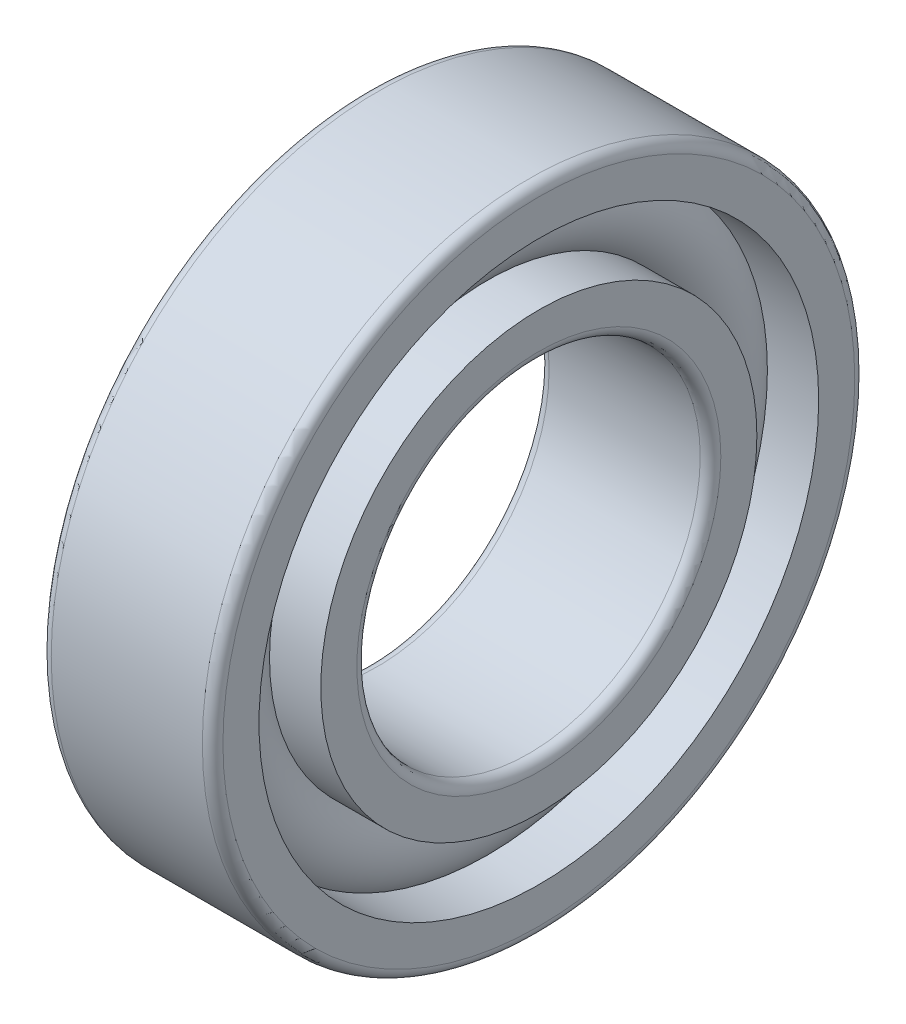
ISO-10303-21;
HEADER;
FILE_DESCRIPTION(('STEP AP214'),'2;1');
FILE_NAME('part.step','',(''),(''),'','','');
FILE_SCHEMA(('AUTOMOTIVE_DESIGN { 1 0 10303 214 1 1 1 1 }'));
ENDSEC;
DATA;
#1=APPLICATION_CONTEXT('core data for automotive mechanical design processes');
#2=APPLICATION_PROTOCOL_DEFINITION('international standard','automotive_design',2000,#1);
#3=PRODUCT_CONTEXT('',#1,'mechanical');
#4=PRODUCT('Part','Part','',(#3));
#5=PRODUCT_RELATED_PRODUCT_CATEGORY('part','',(#4));
#6=PRODUCT_DEFINITION_FORMATION('','',#4);
#7=PRODUCT_DEFINITION_CONTEXT('part definition',#1,'design');
#8=PRODUCT_DEFINITION('design','',#6,#7);
#9=PRODUCT_DEFINITION_SHAPE('','',#8);
#10=(LENGTH_UNIT() NAMED_UNIT(*) SI_UNIT(.MILLI.,.METRE.));
#11=(NAMED_UNIT(*) PLANE_ANGLE_UNIT() SI_UNIT($,.RADIAN.));
#12=(NAMED_UNIT(*) SI_UNIT($,.STERADIAN.) SOLID_ANGLE_UNIT());
#13=UNCERTAINTY_MEASURE_WITH_UNIT(LENGTH_MEASURE(1.E-05),#10,'distance_accuracy_value','');
#14=(GEOMETRIC_REPRESENTATION_CONTEXT(3) GLOBAL_UNCERTAINTY_ASSIGNED_CONTEXT((#13)) GLOBAL_UNIT_ASSIGNED_CONTEXT((#10,
#11,#12)) REPRESENTATION_CONTEXT('',''));
#15=CARTESIAN_POINT('',(0.,0.,0.));
#16=DIRECTION('',(0.,0.,1.));
#17=DIRECTION('',(1.,0.,0.));
#18=AXIS2_PLACEMENT_3D('',#15,#16,#17);
#19=CARTESIAN_POINT('',(0.,0.,0.));
#20=DIRECTION('',(-1.,0.,0.));
#21=DIRECTION('',(0.,0.,1.));
#22=AXIS2_PLACEMENT_3D('',#19,#20,#21);
#23=TOROIDAL_SURFACE('',#22,7.25,1.35);
#24=CARTESIAN_POINT('',(1.0062305898749,0.,0.));
#25=DIRECTION('',(-1.,0.,0.));
#26=DIRECTION('',(0.,0.,1.));
#27=AXIS2_PLACEMENT_3D('',#24,#25,#26);
#28=CIRCLE('',#27,8.15000000000001);
#29=CARTESIAN_POINT('',(1.0062305898749,0.,8.15000000000001));
#30=VERTEX_POINT('',#29);
#31=EDGE_CURVE('E35',#30,#30,#28,.F.);
#32=ORIENTED_EDGE('',*,*,#31,.T.);
#33=EDGE_LOOP('',(#32));
#34=FACE_BOUND('',#33,.T.);
#35=CARTESIAN_POINT('',(1.00623058987491,0.,0.));
#36=DIRECTION('',(-1.,0.,0.));
#37=DIRECTION('',(0.,0.,1.));
#38=AXIS2_PLACEMENT_3D('',#35,#36,#37);
#39=CIRCLE('',#38,6.35);
#40=CARTESIAN_POINT('',(1.00623058987491,0.,6.35));
#41=VERTEX_POINT('',#40);
#42=EDGE_CURVE('E10',#41,#41,#39,.T.);
#43=ORIENTED_EDGE('',*,*,#42,.T.);
#44=EDGE_LOOP('',(#43));
#45=FACE_BOUND('',#44,.T.);
#46=ADVANCED_FACE('F31',(#34,#45),#23,.T.);
#47=CARTESIAN_POINT('',(-20.6375,0.,0.));
#48=DIRECTION('',(1.,0.,0.));
#49=DIRECTION('',(0.,0.,-1.));
#50=AXIS2_PLACEMENT_3D('',#47,#48,#49);
#51=CYLINDRICAL_SURFACE('',#50,6.35);
#52=CARTESIAN_POINT('',(2.5,0.,0.));
#53=DIRECTION('',(1.,0.,0.));
#54=DIRECTION('',(0.,0.,-1.));
#55=AXIS2_PLACEMENT_3D('',#52,#53,#54);
#56=CIRCLE('',#55,6.35);
#57=CARTESIAN_POINT('',(2.5,0.,-6.35));
#58=VERTEX_POINT('',#57);
#59=EDGE_CURVE('E44',#58,#58,#56,.T.);
#60=ORIENTED_EDGE('',*,*,#59,.F.);
#61=EDGE_LOOP('',(#60));
#62=FACE_BOUND('',#61,.T.);
#63=ORIENTED_EDGE('',*,*,#42,.F.);
#64=EDGE_LOOP('',(#63));
#65=FACE_BOUND('',#64,.T.);
#66=ADVANCED_FACE('F83',(#62,#65),#51,.T.);
#67=CARTESIAN_POINT('',(-20.6375,0.,0.));
#68=DIRECTION('',(1.,0.,0.));
#69=DIRECTION('',(0.,0.,-1.));
#70=AXIS2_PLACEMENT_3D('',#67,#68,#69);
#71=CYLINDRICAL_SURFACE('',#70,6.35);
#72=CARTESIAN_POINT('',(-2.5,0.,0.));
#73=DIRECTION('',(1.,0.,0.));
#74=DIRECTION('',(0.,0.,-1.));
#75=AXIS2_PLACEMENT_3D('',#72,#73,#74);
#76=CIRCLE('',#75,6.35);
#77=CARTESIAN_POINT('',(-2.5,0.,-6.35));
#78=VERTEX_POINT('',#77);
#79=EDGE_CURVE('E53',#78,#78,#76,.T.);
#80=ORIENTED_EDGE('',*,*,#79,.T.);
#81=EDGE_LOOP('',(#80));
#82=FACE_BOUND('',#81,.T.);
#83=CARTESIAN_POINT('',(-1.00623058987491,0.,0.));
#84=DIRECTION('',(1.,0.,0.));
#85=DIRECTION('',(0.,0.,-1.));
#86=AXIS2_PLACEMENT_3D('',#83,#84,#85);
#87=CIRCLE('',#86,6.35);
#88=CARTESIAN_POINT('',(-1.00623058987491,0.,-6.35));
#89=VERTEX_POINT('',#88);
#90=EDGE_CURVE('E39',#89,#89,#87,.T.);
#91=ORIENTED_EDGE('',*,*,#90,.F.);
#92=EDGE_LOOP('',(#91));
#93=FACE_BOUND('',#92,.T.);
#94=ADVANCED_FACE('F86',(#82,#93),#71,.T.);
#95=CARTESIAN_POINT('',(2.5,5.3,0.));
#96=DIRECTION('',(1.,0.,0.));
#97=DIRECTION('',(0.,0.,-1.));
#98=AXIS2_PLACEMENT_3D('',#95,#96,#97);
#99=PLANE('',#98);
#100=ORIENTED_EDGE('',*,*,#59,.T.);
#101=EDGE_LOOP('',(#100));
#102=FACE_BOUND('',#101,.T.);
#103=CARTESIAN_POINT('',(2.5,0.,0.));
#104=DIRECTION('',(1.,0.,0.));
#105=DIRECTION('',(0.,0.,-1.));
#106=AXIS2_PLACEMENT_3D('',#103,#104,#105);
#107=CIRCLE('',#106,5.3);
#108=CARTESIAN_POINT('',(2.5,0.,-5.3));
#109=VERTEX_POINT('',#108);
#110=EDGE_CURVE('E75',#109,#109,#107,.T.);
#111=ORIENTED_EDGE('',*,*,#110,.F.);
#112=EDGE_LOOP('',(#111));
#113=FACE_BOUND('',#112,.T.);
#114=ADVANCED_FACE('F80',(#102,#113),#99,.T.);
#115=CARTESIAN_POINT('',(2.2,0.,0.));
#116=DIRECTION('',(1.,0.,0.));
#117=DIRECTION('',(0.,0.,-1.));
#118=AXIS2_PLACEMENT_3D('',#115,#116,#117);
#119=TOROIDAL_SURFACE('',#118,5.3,0.3);
#120=ORIENTED_EDGE('',*,*,#110,.T.);
#121=EDGE_LOOP('',(#120));
#122=FACE_BOUND('',#121,.T.);
#123=CARTESIAN_POINT('',(2.2,0.,0.));
#124=DIRECTION('',(1.,0.,0.));
#125=DIRECTION('',(0.,0.,-1.));
#126=AXIS2_PLACEMENT_3D('',#123,#124,#125);
#127=CIRCLE('',#126,5.);
#128=CARTESIAN_POINT('',(2.2,0.,-5.));
#129=VERTEX_POINT('',#128);
#130=EDGE_CURVE('E72',#129,#129,#127,.T.);
#131=ORIENTED_EDGE('',*,*,#130,.F.);
#132=EDGE_LOOP('',(#131));
#133=FACE_BOUND('',#132,.T.);
#134=ADVANCED_FACE('F97',(#122,#133),#119,.T.);
#135=CARTESIAN_POINT('',(-20.6375,0.,0.));
#136=DIRECTION('',(1.,0.,0.));
#137=DIRECTION('',(0.,0.,-1.));
#138=AXIS2_PLACEMENT_3D('',#135,#136,#137);
#139=CYLINDRICAL_SURFACE('',#138,5.);
#140=ORIENTED_EDGE('',*,*,#130,.T.);
#141=EDGE_LOOP('',(#140));
#142=FACE_BOUND('',#141,.T.);
#143=CARTESIAN_POINT('',(-2.2,0.,0.));
#144=DIRECTION('',(1.,0.,0.));
#145=DIRECTION('',(0.,0.,-1.));
#146=AXIS2_PLACEMENT_3D('',#143,#144,#145);
#147=CIRCLE('',#146,5.);
#148=CARTESIAN_POINT('',(-2.2,0.,-5.));
#149=VERTEX_POINT('',#148);
#150=EDGE_CURVE('E69',#149,#149,#147,.T.);
#151=ORIENTED_EDGE('',*,*,#150,.F.);
#152=EDGE_LOOP('',(#151));
#153=FACE_BOUND('',#152,.T.);
#154=ADVANCED_FACE('F100',(#142,#153),#139,.F.);
#155=CARTESIAN_POINT('',(-2.2,0.,0.));
#156=DIRECTION('',(1.,0.,0.));
#157=DIRECTION('',(0.,0.,-1.));
#158=AXIS2_PLACEMENT_3D('',#155,#156,#157);
#159=TOROIDAL_SURFACE('',#158,5.3,0.3);
#160=ORIENTED_EDGE('',*,*,#150,.T.);
#161=EDGE_LOOP('',(#160));
#162=FACE_BOUND('',#161,.T.);
#163=CARTESIAN_POINT('',(-2.5,0.,0.));
#164=DIRECTION('',(1.,0.,0.));
#165=DIRECTION('',(0.,0.,-1.));
#166=AXIS2_PLACEMENT_3D('',#163,#164,#165);
#167=CIRCLE('',#166,5.3);
#168=CARTESIAN_POINT('',(-2.5,0.,-5.3));
#169=VERTEX_POINT('',#168);
#170=EDGE_CURVE('E66',#169,#169,#167,.T.);
#171=ORIENTED_EDGE('',*,*,#170,.F.);
#172=EDGE_LOOP('',(#171));
#173=FACE_BOUND('',#172,.T.);
#174=ADVANCED_FACE('F104',(#162,#173),#159,.T.);
#175=CARTESIAN_POINT('',(-2.5,6.35,0.));
#176=DIRECTION('',(-1.,0.,0.));
#177=DIRECTION('',(0.,0.,1.));
#178=AXIS2_PLACEMENT_3D('',#175,#176,#177);
#179=PLANE('',#178);
#180=ORIENTED_EDGE('',*,*,#170,.T.);
#181=EDGE_LOOP('',(#180));
#182=FACE_BOUND('',#181,.T.);
#183=ORIENTED_EDGE('',*,*,#79,.F.);
#184=EDGE_LOOP('',(#183));
#185=FACE_BOUND('',#184,.T.);
#186=ADVANCED_FACE('F108',(#182,#185),#179,.T.);
#187=CARTESIAN_POINT('',(-1.0062305898749,0.,0.));
#188=DIRECTION('',(1.,0.,0.));
#189=DIRECTION('',(0.,0.,-1.));
#190=AXIS2_PLACEMENT_3D('',#187,#188,#189);
#191=CIRCLE('',#190,8.15000000000001);
#192=CARTESIAN_POINT('',(-1.0062305898749,0.,-8.15000000000001));
#193=VERTEX_POINT('',#192);
#194=EDGE_CURVE('E47',#193,#193,#191,.F.);
#195=ORIENTED_EDGE('',*,*,#194,.T.);
#196=EDGE_LOOP('',(#195));
#197=FACE_BOUND('',#196,.T.);
#198=ORIENTED_EDGE('',*,*,#90,.T.);
#199=EDGE_LOOP('',(#198));
#200=FACE_BOUND('',#199,.T.);
#201=ADVANCED_FACE('F33',(#197,#200),#23,.T.);
#202=CARTESIAN_POINT('',(-20.6375,0.,0.));
#203=DIRECTION('',(1.,0.,0.));
#204=DIRECTION('',(0.,0.,-1.));
#205=AXIS2_PLACEMENT_3D('',#202,#203,#204);
#206=CYLINDRICAL_SURFACE('',#205,8.15000000000001);
#207=CARTESIAN_POINT('',(2.5,0.,0.));
#208=DIRECTION('',(1.,0.,0.));
#209=DIRECTION('',(0.,0.,-1.));
#210=AXIS2_PLACEMENT_3D('',#207,#208,#209);
#211=CIRCLE('',#210,8.15000000000001);
#212=CARTESIAN_POINT('',(2.5,0.,-8.15000000000001));
#213=VERTEX_POINT('',#212);
#214=EDGE_CURVE('E49',#213,#213,#211,.T.);
#215=ORIENTED_EDGE('',*,*,#214,.T.);
#216=EDGE_LOOP('',(#215));
#217=FACE_BOUND('',#216,.T.);
#218=ORIENTED_EDGE('',*,*,#31,.F.);
#219=EDGE_LOOP('',(#218));
#220=FACE_BOUND('',#219,.T.);
#221=ADVANCED_FACE('F113',(#217,#220),#206,.F.);
#222=CARTESIAN_POINT('',(-20.6375,0.,0.));
#223=DIRECTION('',(1.,0.,0.));
#224=DIRECTION('',(0.,0.,-1.));
#225=AXIS2_PLACEMENT_3D('',#222,#223,#224);
#226=CYLINDRICAL_SURFACE('',#225,8.15000000000001);
#227=CARTESIAN_POINT('',(-2.5,0.,0.));
#228=DIRECTION('',(1.,0.,0.));
#229=DIRECTION('',(0.,0.,-1.));
#230=AXIS2_PLACEMENT_3D('',#227,#228,#229);
#231=CIRCLE('',#230,8.15000000000001);
#232=CARTESIAN_POINT('',(-2.5,0.,-8.15000000000001));
#233=VERTEX_POINT('',#232);
#234=EDGE_CURVE('E144',#233,#233,#231,.T.);
#235=ORIENTED_EDGE('',*,*,#234,.F.);
#236=EDGE_LOOP('',(#235));
#237=FACE_BOUND('',#236,.T.);
#238=ORIENTED_EDGE('',*,*,#194,.F.);
#239=EDGE_LOOP('',(#238));
#240=FACE_BOUND('',#239,.T.);
#241=ADVANCED_FACE('F116',(#237,#240),#226,.F.);
#242=CARTESIAN_POINT('',(2.5,9.2,0.));
#243=DIRECTION('',(1.,0.,0.));
#244=DIRECTION('',(0.,0.,-1.));
#245=AXIS2_PLACEMENT_3D('',#242,#243,#244);
#246=PLANE('',#245);
#247=CARTESIAN_POINT('',(2.5,0.,0.));
#248=DIRECTION('',(1.,0.,0.));
#249=DIRECTION('',(0.,0.,-1.));
#250=AXIS2_PLACEMENT_3D('',#247,#248,#249);
#251=CIRCLE('',#250,9.2);
#252=CARTESIAN_POINT('',(2.5,0.,-9.2));
#253=VERTEX_POINT('',#252);
#254=EDGE_CURVE('E55',#253,#253,#251,.T.);
#255=ORIENTED_EDGE('',*,*,#254,.T.);
#256=EDGE_LOOP('',(#255));
#257=FACE_BOUND('',#256,.T.);
#258=ORIENTED_EDGE('',*,*,#214,.F.);
#259=EDGE_LOOP('',(#258));
#260=FACE_BOUND('',#259,.T.);
#261=ADVANCED_FACE('F117',(#257,#260),#246,.T.);
#262=CARTESIAN_POINT('',(2.2,0.,0.));
#263=DIRECTION('',(1.,0.,0.));
#264=DIRECTION('',(0.,0.,-1.));
#265=AXIS2_PLACEMENT_3D('',#262,#263,#264);
#266=TOROIDAL_SURFACE('',#265,9.2,0.300000000000001);
#267=CARTESIAN_POINT('',(2.2,0.,0.));
#268=DIRECTION('',(1.,0.,0.));
#269=DIRECTION('',(0.,0.,-1.));
#270=AXIS2_PLACEMENT_3D('',#267,#268,#269);
#271=CIRCLE('',#270,9.50000000000001);
#272=CARTESIAN_POINT('',(2.2,0.,-9.50000000000001));
#273=VERTEX_POINT('',#272);
#274=EDGE_CURVE('E60',#273,#273,#271,.T.);
#275=ORIENTED_EDGE('',*,*,#274,.T.);
#276=EDGE_LOOP('',(#275));
#277=FACE_BOUND('',#276,.T.);
#278=ORIENTED_EDGE('',*,*,#254,.F.);
#279=EDGE_LOOP('',(#278));
#280=FACE_BOUND('',#279,.T.);
#281=ADVANCED_FACE('F120',(#277,#280),#266,.T.);
#282=CARTESIAN_POINT('',(-20.6375,0.,0.));
#283=DIRECTION('',(1.,0.,0.));
#284=DIRECTION('',(0.,0.,-1.));
#285=AXIS2_PLACEMENT_3D('',#282,#283,#284);
#286=CYLINDRICAL_SURFACE('',#285,9.50000000000001);
#287=CARTESIAN_POINT('',(-2.2,0.,0.));
#288=DIRECTION('',(1.,0.,0.));
#289=DIRECTION('',(0.,0.,-1.));
#290=AXIS2_PLACEMENT_3D('',#287,#288,#289);
#291=CIRCLE('',#290,9.50000000000001);
#292=CARTESIAN_POINT('',(-2.2,0.,-9.50000000000001));
#293=VERTEX_POINT('',#292);
#294=EDGE_CURVE('E148',#293,#293,#291,.T.);
#295=ORIENTED_EDGE('',*,*,#294,.T.);
#296=EDGE_LOOP('',(#295));
#297=FACE_BOUND('',#296,.T.);
#298=ORIENTED_EDGE('',*,*,#274,.F.);
#299=EDGE_LOOP('',(#298));
#300=FACE_BOUND('',#299,.T.);
#301=ADVANCED_FACE('F124',(#297,#300),#286,.T.);
#302=CARTESIAN_POINT('',(-2.2,0.,0.));
#303=DIRECTION('',(1.,0.,0.));
#304=DIRECTION('',(0.,0.,-1.));
#305=AXIS2_PLACEMENT_3D('',#302,#303,#304);
#306=TOROIDAL_SURFACE('',#305,9.2,0.300000000000001);
#307=CARTESIAN_POINT('',(-2.5,0.,0.));
#308=DIRECTION('',(1.,0.,0.));
#309=DIRECTION('',(0.,0.,-1.));
#310=AXIS2_PLACEMENT_3D('',#307,#308,#309);
#311=CIRCLE('',#310,9.2);
#312=CARTESIAN_POINT('',(-2.5,0.,-9.2));
#313=VERTEX_POINT('',#312);
#314=EDGE_CURVE('E145',#313,#313,#311,.T.);
#315=ORIENTED_EDGE('',*,*,#314,.T.);
#316=EDGE_LOOP('',(#315));
#317=FACE_BOUND('',#316,.T.);
#318=ORIENTED_EDGE('',*,*,#294,.F.);
#319=EDGE_LOOP('',(#318));
#320=FACE_BOUND('',#319,.T.);
#321=ADVANCED_FACE('F128',(#317,#320),#306,.T.);
#322=CARTESIAN_POINT('',(-2.5,8.15000000000001,0.));
#323=DIRECTION('',(-1.,0.,0.));
#324=DIRECTION('',(0.,0.,1.));
#325=AXIS2_PLACEMENT_3D('',#322,#323,#324);
#326=PLANE('',#325);
#327=ORIENTED_EDGE('',*,*,#234,.T.);
#328=EDGE_LOOP('',(#327));
#329=FACE_BOUND('',#328,.T.);
#330=ORIENTED_EDGE('',*,*,#314,.F.);
#331=EDGE_LOOP('',(#330));
#332=FACE_BOUND('',#331,.T.);
#333=ADVANCED_FACE('F132',(#329,#332),#326,.T.);
#334=CLOSED_SHELL('',(#46,#66,#94,#114,#134,#154,#174,#186,#201,#221,#241,#261,#281,#301,#321,#333));
#335=MANIFOLD_SOLID_BREP('B2',#334);
#336=ADVANCED_BREP_SHAPE_REPRESENTATION('',(#18,#335),#14);
#337=SHAPE_DEFINITION_REPRESENTATION(#9,#336);
ENDSEC;
END-ISO-10303-21;
